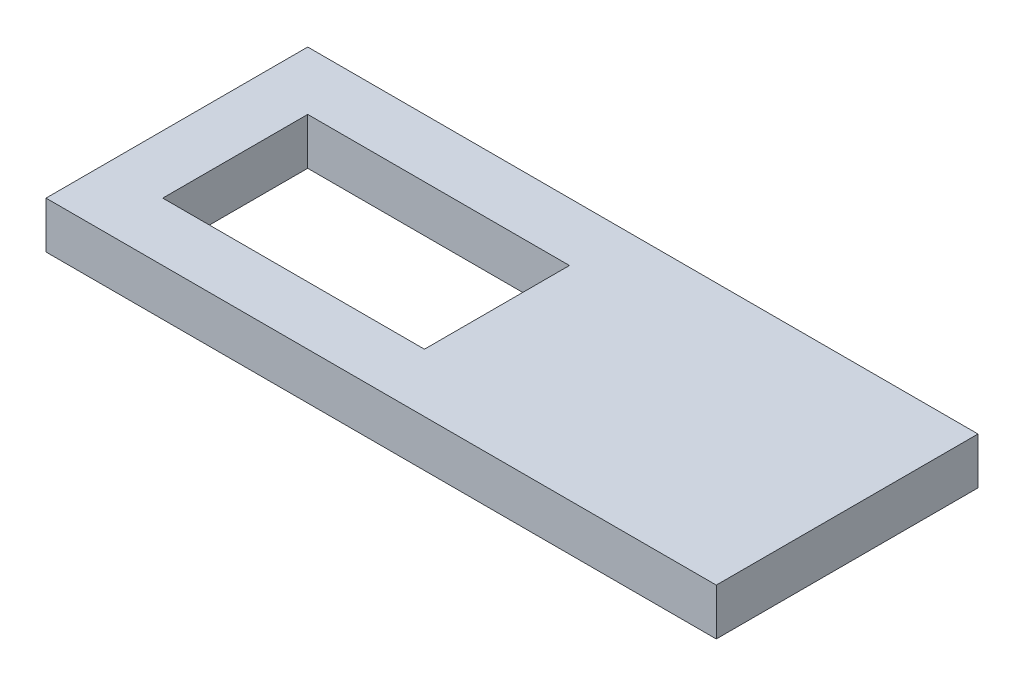
ISO-10303-21;
HEADER;
FILE_DESCRIPTION(('STEP AP214'),'2;1');
FILE_NAME('part.step','',(''),(''),'','','');
FILE_SCHEMA(('AUTOMOTIVE_DESIGN { 1 0 10303 214 1 1 1 1 }'));
ENDSEC;
DATA;
#1=APPLICATION_CONTEXT('core data for automotive mechanical design processes');
#2=APPLICATION_PROTOCOL_DEFINITION('international standard','automotive_design',2000,#1);
#3=PRODUCT_CONTEXT('',#1,'mechanical');
#4=PRODUCT('Part','Part','',(#3));
#5=PRODUCT_RELATED_PRODUCT_CATEGORY('part','',(#4));
#6=PRODUCT_DEFINITION_FORMATION('','',#4);
#7=PRODUCT_DEFINITION_CONTEXT('part definition',#1,'design');
#8=PRODUCT_DEFINITION('design','',#6,#7);
#9=PRODUCT_DEFINITION_SHAPE('','',#8);
#10=(LENGTH_UNIT() NAMED_UNIT(*) SI_UNIT(.MILLI.,.METRE.));
#11=(NAMED_UNIT(*) PLANE_ANGLE_UNIT() SI_UNIT($,.RADIAN.));
#12=(NAMED_UNIT(*) SI_UNIT($,.STERADIAN.) SOLID_ANGLE_UNIT());
#13=UNCERTAINTY_MEASURE_WITH_UNIT(LENGTH_MEASURE(1.E-05),#10,'distance_accuracy_value','');
#14=(GEOMETRIC_REPRESENTATION_CONTEXT(3) GLOBAL_UNCERTAINTY_ASSIGNED_CONTEXT((#13)) GLOBAL_UNIT_ASSIGNED_CONTEXT((#10,
#11,#12)) REPRESENTATION_CONTEXT('',''));
#15=CARTESIAN_POINT('',(0.,0.,0.));
#16=DIRECTION('',(0.,0.,1.));
#17=DIRECTION('',(1.,0.,0.));
#18=AXIS2_PLACEMENT_3D('',#15,#16,#17);
#19=CARTESIAN_POINT('',(0.,4.,0.));
#20=DIRECTION('',(0.,1.,0.));
#21=DIRECTION('',(0.,0.,1.));
#22=AXIS2_PLACEMENT_3D('',#19,#20,#21);
#23=PLANE('',#22);
#24=DIRECTION('',(0.,0.,1.));
#25=VECTOR('',#24,1.);
#26=CARTESIAN_POINT('',(-5.,4.,-17.42));
#27=LINE('',#26,#25);
#28=CARTESIAN_POINT('',(-5.,4.,-17.42));
#29=VERTEX_POINT('',#28);
#30=CARTESIAN_POINT('',(-5.,4.,5.));
#31=VERTEX_POINT('',#30);
#32=EDGE_CURVE('E153',#29,#31,#27,.T.);
#33=ORIENTED_EDGE('',*,*,#32,.T.);
#34=DIRECTION('',(1.,0.,0.));
#35=VECTOR('',#34,1.);
#36=CARTESIAN_POINT('',(-5.,4.,5.));
#37=LINE('',#36,#35);
#38=CARTESIAN_POINT('',(52.42,4.,5.));
#39=VERTEX_POINT('',#38);
#40=EDGE_CURVE('E157',#31,#39,#37,.T.);
#41=ORIENTED_EDGE('',*,*,#40,.T.);
#42=DIRECTION('',(0.,0.,-1.));
#43=VECTOR('',#42,1.);
#44=CARTESIAN_POINT('',(52.42,4.,-17.42));
#45=LINE('',#44,#43);
#46=CARTESIAN_POINT('',(52.42,4.,-17.42));
#47=VERTEX_POINT('',#46);
#48=EDGE_CURVE('E161',#39,#47,#45,.T.);
#49=ORIENTED_EDGE('',*,*,#48,.T.);
#50=DIRECTION('',(-1.,0.,0.));
#51=VECTOR('',#50,1.);
#52=CARTESIAN_POINT('',(-5.,4.,-17.42));
#53=LINE('',#52,#51);
#54=EDGE_CURVE('E164',#47,#29,#53,.T.);
#55=ORIENTED_EDGE('',*,*,#54,.T.);
#56=EDGE_LOOP('',(#33,#41,#49,#55));
#57=FACE_BOUND('',#56,.T.);
#58=DIRECTION('',(1.,0.,0.));
#59=VECTOR('',#58,1.);
#60=CARTESIAN_POINT('',(0.,4.,0.));
#61=LINE('',#60,#59);
#62=CARTESIAN_POINT('',(0.,4.,0.));
#63=VERTEX_POINT('',#62);
#64=CARTESIAN_POINT('',(22.42,4.,0.));
#65=VERTEX_POINT('',#64);
#66=EDGE_CURVE('E114',#63,#65,#61,.T.);
#67=ORIENTED_EDGE('',*,*,#66,.F.);
#68=DIRECTION('',(0.,0.,1.));
#69=VECTOR('',#68,1.);
#70=CARTESIAN_POINT('',(0.,4.,0.));
#71=LINE('',#70,#69);
#72=CARTESIAN_POINT('',(0.,4.,-12.42));
#73=VERTEX_POINT('',#72);
#74=EDGE_CURVE('E105',#73,#63,#71,.T.);
#75=ORIENTED_EDGE('',*,*,#74,.F.);
#76=DIRECTION('',(-1.,0.,0.));
#77=VECTOR('',#76,1.);
#78=CARTESIAN_POINT('',(0.,4.,-12.42));
#79=LINE('',#78,#77);
#80=CARTESIAN_POINT('',(22.42,4.,-12.42));
#81=VERTEX_POINT('',#80);
#82=EDGE_CURVE('E131',#81,#73,#79,.T.);
#83=ORIENTED_EDGE('',*,*,#82,.F.);
#84=DIRECTION('',(0.,0.,-1.));
#85=VECTOR('',#84,1.);
#86=CARTESIAN_POINT('',(22.42,4.,0.));
#87=LINE('',#86,#85);
#88=EDGE_CURVE('E127',#65,#81,#87,.T.);
#89=ORIENTED_EDGE('',*,*,#88,.F.);
#90=EDGE_LOOP('',(#67,#75,#83,#89));
#91=FACE_BOUND('',#90,.T.);
#92=ADVANCED_FACE('F39',(#57,#91),#23,.T.);
#93=CARTESIAN_POINT('',(0.,0.,0.));
#94=DIRECTION('',(0.,1.,0.));
#95=DIRECTION('',(0.,0.,1.));
#96=AXIS2_PLACEMENT_3D('',#93,#94,#95);
#97=PLANE('',#96);
#98=DIRECTION('',(0.,0.,1.));
#99=VECTOR('',#98,1.);
#100=CARTESIAN_POINT('',(-5.,0.,-17.42));
#101=LINE('',#100,#99);
#102=CARTESIAN_POINT('',(-5.,0.,-17.42));
#103=VERTEX_POINT('',#102);
#104=CARTESIAN_POINT('',(-5.,0.,5.));
#105=VERTEX_POINT('',#104);
#106=EDGE_CURVE('E123',#103,#105,#101,.T.);
#107=ORIENTED_EDGE('',*,*,#106,.F.);
#108=DIRECTION('',(-1.,0.,0.));
#109=VECTOR('',#108,1.);
#110=CARTESIAN_POINT('',(-5.,0.,-17.42));
#111=LINE('',#110,#109);
#112=CARTESIAN_POINT('',(52.42,0.,-17.42));
#113=VERTEX_POINT('',#112);
#114=EDGE_CURVE('E158',#113,#103,#111,.T.);
#115=ORIENTED_EDGE('',*,*,#114,.F.);
#116=DIRECTION('',(0.,0.,-1.));
#117=VECTOR('',#116,1.);
#118=CARTESIAN_POINT('',(52.42,0.,-17.42));
#119=LINE('',#118,#117);
#120=CARTESIAN_POINT('',(52.42,0.,5.));
#121=VERTEX_POINT('',#120);
#122=EDGE_CURVE('E174',#121,#113,#119,.T.);
#123=ORIENTED_EDGE('',*,*,#122,.F.);
#124=DIRECTION('',(1.,0.,0.));
#125=VECTOR('',#124,1.);
#126=CARTESIAN_POINT('',(-5.,0.,5.));
#127=LINE('',#126,#125);
#128=EDGE_CURVE('E171',#105,#121,#127,.T.);
#129=ORIENTED_EDGE('',*,*,#128,.F.);
#130=EDGE_LOOP('',(#107,#115,#123,#129));
#131=FACE_BOUND('',#130,.T.);
#132=DIRECTION('',(0.,0.,1.));
#133=VECTOR('',#132,1.);
#134=CARTESIAN_POINT('',(0.,0.,0.));
#135=LINE('',#134,#133);
#136=CARTESIAN_POINT('',(0.,0.,-12.42));
#137=VERTEX_POINT('',#136);
#138=CARTESIAN_POINT('',(0.,0.,0.));
#139=VERTEX_POINT('',#138);
#140=EDGE_CURVE('E63',#137,#139,#135,.T.);
#141=ORIENTED_EDGE('',*,*,#140,.T.);
#142=DIRECTION('',(1.,0.,0.));
#143=VECTOR('',#142,1.);
#144=CARTESIAN_POINT('',(0.,0.,0.));
#145=LINE('',#144,#143);
#146=CARTESIAN_POINT('',(22.42,0.,0.));
#147=VERTEX_POINT('',#146);
#148=EDGE_CURVE('E121',#139,#147,#145,.T.);
#149=ORIENTED_EDGE('',*,*,#148,.T.);
#150=DIRECTION('',(0.,0.,-1.));
#151=VECTOR('',#150,1.);
#152=CARTESIAN_POINT('',(22.42,0.,0.));
#153=LINE('',#152,#151);
#154=CARTESIAN_POINT('',(22.42,0.,-12.42));
#155=VERTEX_POINT('',#154);
#156=EDGE_CURVE('E140',#147,#155,#153,.T.);
#157=ORIENTED_EDGE('',*,*,#156,.T.);
#158=DIRECTION('',(-1.,0.,0.));
#159=VECTOR('',#158,1.);
#160=CARTESIAN_POINT('',(0.,0.,-12.42));
#161=LINE('',#160,#159);
#162=EDGE_CURVE('E115',#155,#137,#161,.T.);
#163=ORIENTED_EDGE('',*,*,#162,.T.);
#164=EDGE_LOOP('',(#141,#149,#157,#163));
#165=FACE_BOUND('',#164,.T.);
#166=ADVANCED_FACE('F197',(#131,#165),#97,.F.);
#167=CARTESIAN_POINT('',(-5.,4.,-17.42));
#168=DIRECTION('',(1.,0.,0.));
#169=DIRECTION('',(0.,0.,-1.));
#170=AXIS2_PLACEMENT_3D('',#167,#168,#169);
#171=PLANE('',#170);
#172=ORIENTED_EDGE('',*,*,#106,.T.);
#173=DIRECTION('',(0.,-1.,0.));
#174=VECTOR('',#173,1.);
#175=CARTESIAN_POINT('',(-5.,4.,5.));
#176=LINE('',#175,#174);
#177=EDGE_CURVE('E11',#31,#105,#176,.T.);
#178=ORIENTED_EDGE('',*,*,#177,.F.);
#179=ORIENTED_EDGE('',*,*,#32,.F.);
#180=DIRECTION('',(0.,-1.,0.));
#181=VECTOR('',#180,1.);
#182=CARTESIAN_POINT('',(-5.,4.,-17.42));
#183=LINE('',#182,#181);
#184=EDGE_CURVE('E167',#29,#103,#183,.T.);
#185=ORIENTED_EDGE('',*,*,#184,.T.);
#186=EDGE_LOOP('',(#172,#178,#179,#185));
#187=FACE_BOUND('',#186,.T.);
#188=ADVANCED_FACE('F41',(#187),#171,.F.);
#189=CARTESIAN_POINT('',(-5.,4.,5.));
#190=DIRECTION('',(0.,0.,-1.));
#191=DIRECTION('',(-1.,0.,0.));
#192=AXIS2_PLACEMENT_3D('',#189,#190,#191);
#193=PLANE('',#192);
#194=ORIENTED_EDGE('',*,*,#128,.T.);
#195=DIRECTION('',(0.,-1.,0.));
#196=VECTOR('',#195,1.);
#197=CARTESIAN_POINT('',(52.42,4.,5.));
#198=LINE('',#197,#196);
#199=EDGE_CURVE('E48',#39,#121,#198,.T.);
#200=ORIENTED_EDGE('',*,*,#199,.F.);
#201=ORIENTED_EDGE('',*,*,#40,.F.);
#202=ORIENTED_EDGE('',*,*,#177,.T.);
#203=EDGE_LOOP('',(#194,#200,#201,#202));
#204=FACE_BOUND('',#203,.T.);
#205=ADVANCED_FACE('F207',(#204),#193,.F.);
#206=CARTESIAN_POINT('',(52.42,4.,-17.42));
#207=DIRECTION('',(-1.,0.,0.));
#208=DIRECTION('',(0.,0.,1.));
#209=AXIS2_PLACEMENT_3D('',#206,#207,#208);
#210=PLANE('',#209);
#211=ORIENTED_EDGE('',*,*,#122,.T.);
#212=DIRECTION('',(0.,-1.,0.));
#213=VECTOR('',#212,1.);
#214=CARTESIAN_POINT('',(52.42,4.,-17.42));
#215=LINE('',#214,#213);
#216=EDGE_CURVE('E182',#47,#113,#215,.T.);
#217=ORIENTED_EDGE('',*,*,#216,.F.);
#218=ORIENTED_EDGE('',*,*,#48,.F.);
#219=ORIENTED_EDGE('',*,*,#199,.T.);
#220=EDGE_LOOP('',(#211,#217,#218,#219));
#221=FACE_BOUND('',#220,.T.);
#222=ADVANCED_FACE('F191',(#221),#210,.F.);
#223=CARTESIAN_POINT('',(-5.,4.,-17.42));
#224=DIRECTION('',(0.,0.,1.));
#225=DIRECTION('',(1.,0.,0.));
#226=AXIS2_PLACEMENT_3D('',#223,#224,#225);
#227=PLANE('',#226);
#228=ORIENTED_EDGE('',*,*,#114,.T.);
#229=ORIENTED_EDGE('',*,*,#184,.F.);
#230=ORIENTED_EDGE('',*,*,#54,.F.);
#231=ORIENTED_EDGE('',*,*,#216,.T.);
#232=EDGE_LOOP('',(#228,#229,#230,#231));
#233=FACE_BOUND('',#232,.T.);
#234=ADVANCED_FACE('F201',(#233),#227,.F.);
#235=CARTESIAN_POINT('',(0.,4.,0.));
#236=DIRECTION('',(1.,0.,0.));
#237=DIRECTION('',(0.,0.,-1.));
#238=AXIS2_PLACEMENT_3D('',#235,#236,#237);
#239=PLANE('',#238);
#240=ORIENTED_EDGE('',*,*,#140,.F.);
#241=DIRECTION('',(0.,-1.,0.));
#242=VECTOR('',#241,1.);
#243=CARTESIAN_POINT('',(0.,4.,-12.42));
#244=LINE('',#243,#242);
#245=EDGE_CURVE('E109',#73,#137,#244,.T.);
#246=ORIENTED_EDGE('',*,*,#245,.F.);
#247=ORIENTED_EDGE('',*,*,#74,.T.);
#248=DIRECTION('',(0.,-1.,0.));
#249=VECTOR('',#248,1.);
#250=CARTESIAN_POINT('',(0.,4.,0.));
#251=LINE('',#250,#249);
#252=EDGE_CURVE('E108',#63,#139,#251,.T.);
#253=ORIENTED_EDGE('',*,*,#252,.T.);
#254=EDGE_LOOP('',(#240,#246,#247,#253));
#255=FACE_BOUND('',#254,.T.);
#256=ADVANCED_FACE('F107',(#255),#239,.T.);
#257=CARTESIAN_POINT('',(0.,4.,0.));
#258=DIRECTION('',(0.,0.,-1.));
#259=DIRECTION('',(-1.,0.,0.));
#260=AXIS2_PLACEMENT_3D('',#257,#258,#259);
#261=PLANE('',#260);
#262=ORIENTED_EDGE('',*,*,#148,.F.);
#263=ORIENTED_EDGE('',*,*,#252,.F.);
#264=ORIENTED_EDGE('',*,*,#66,.T.);
#265=DIRECTION('',(0.,-1.,0.));
#266=VECTOR('',#265,1.);
#267=CARTESIAN_POINT('',(22.42,4.,0.));
#268=LINE('',#267,#266);
#269=EDGE_CURVE('E124',#65,#147,#268,.T.);
#270=ORIENTED_EDGE('',*,*,#269,.T.);
#271=EDGE_LOOP('',(#262,#263,#264,#270));
#272=FACE_BOUND('',#271,.T.);
#273=ADVANCED_FACE('F118',(#272),#261,.T.);
#274=CARTESIAN_POINT('',(22.42,4.,0.));
#275=DIRECTION('',(-1.,0.,0.));
#276=DIRECTION('',(0.,0.,1.));
#277=AXIS2_PLACEMENT_3D('',#274,#275,#276);
#278=PLANE('',#277);
#279=ORIENTED_EDGE('',*,*,#156,.F.);
#280=ORIENTED_EDGE('',*,*,#269,.F.);
#281=ORIENTED_EDGE('',*,*,#88,.T.);
#282=DIRECTION('',(0.,-1.,0.));
#283=VECTOR('',#282,1.);
#284=CARTESIAN_POINT('',(22.42,4.,-12.42));
#285=LINE('',#284,#283);
#286=EDGE_CURVE('E55',#81,#155,#285,.T.);
#287=ORIENTED_EDGE('',*,*,#286,.T.);
#288=EDGE_LOOP('',(#279,#280,#281,#287));
#289=FACE_BOUND('',#288,.T.);
#290=ADVANCED_FACE('F230',(#289),#278,.T.);
#291=CARTESIAN_POINT('',(0.,4.,-12.42));
#292=DIRECTION('',(0.,0.,1.));
#293=DIRECTION('',(1.,0.,0.));
#294=AXIS2_PLACEMENT_3D('',#291,#292,#293);
#295=PLANE('',#294);
#296=ORIENTED_EDGE('',*,*,#162,.F.);
#297=ORIENTED_EDGE('',*,*,#286,.F.);
#298=ORIENTED_EDGE('',*,*,#82,.T.);
#299=ORIENTED_EDGE('',*,*,#245,.T.);
#300=EDGE_LOOP('',(#296,#297,#298,#299));
#301=FACE_BOUND('',#300,.T.);
#302=ADVANCED_FACE('F234',(#301),#295,.T.);
#303=CLOSED_SHELL('',(#92,#166,#188,#205,#222,#234,#256,#273,#290,#302));
#304=MANIFOLD_SOLID_BREP('B2',#303);
#305=ADVANCED_BREP_SHAPE_REPRESENTATION('',(#18,#304),#14);
#306=SHAPE_DEFINITION_REPRESENTATION(#9,#305);
ENDSEC;
END-ISO-10303-21;
